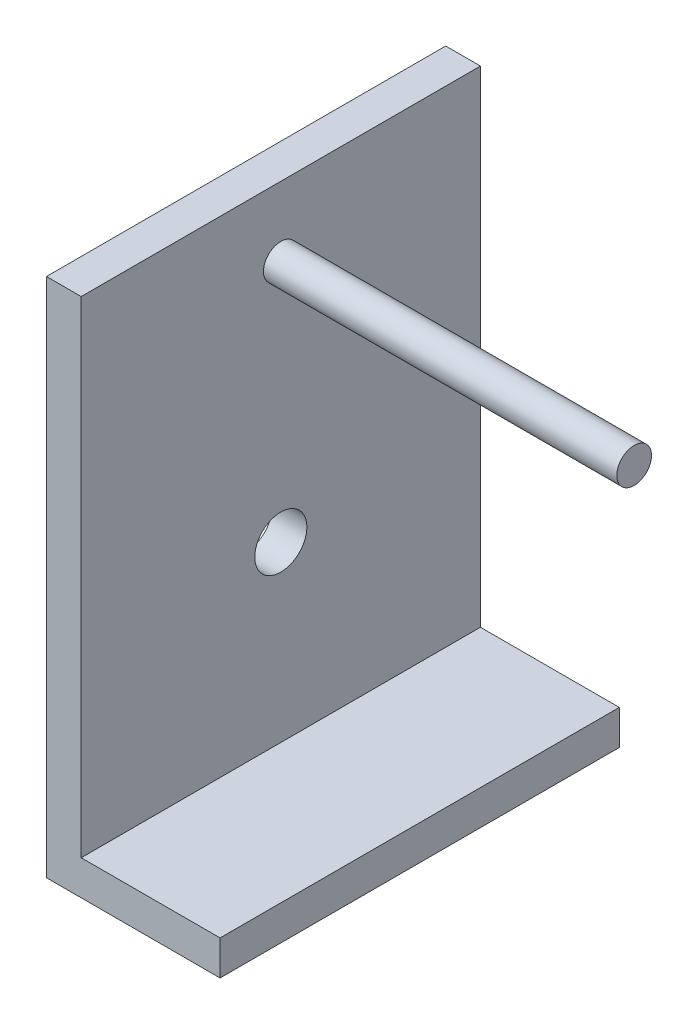
ISO-10303-21;
HEADER;
FILE_DESCRIPTION(('STEP AP214'),'2;1');
FILE_NAME('part.step','',(''),(''),'','','');
FILE_SCHEMA(('AUTOMOTIVE_DESIGN { 1 0 10303 214 1 1 1 1 }'));
ENDSEC;
DATA;
#1=APPLICATION_CONTEXT('core data for automotive mechanical design processes');
#2=APPLICATION_PROTOCOL_DEFINITION('international standard','automotive_design',2000,#1);
#3=PRODUCT_CONTEXT('',#1,'mechanical');
#4=PRODUCT('Part','Part','',(#3));
#5=PRODUCT_RELATED_PRODUCT_CATEGORY('part','',(#4));
#6=PRODUCT_DEFINITION_FORMATION('','',#4);
#7=PRODUCT_DEFINITION_CONTEXT('part definition',#1,'design');
#8=PRODUCT_DEFINITION('design','',#6,#7);
#9=PRODUCT_DEFINITION_SHAPE('','',#8);
#10=(LENGTH_UNIT() NAMED_UNIT(*) SI_UNIT(.MILLI.,.METRE.));
#11=(NAMED_UNIT(*) PLANE_ANGLE_UNIT() SI_UNIT($,.RADIAN.));
#12=(NAMED_UNIT(*) SI_UNIT($,.STERADIAN.) SOLID_ANGLE_UNIT());
#13=UNCERTAINTY_MEASURE_WITH_UNIT(LENGTH_MEASURE(1.E-05),#10,'distance_accuracy_value','');
#14=(GEOMETRIC_REPRESENTATION_CONTEXT(3) GLOBAL_UNCERTAINTY_ASSIGNED_CONTEXT((#13)) GLOBAL_UNIT_ASSIGNED_CONTEXT((#10,
#11,#12)) REPRESENTATION_CONTEXT('',''));
#15=CARTESIAN_POINT('',(0.,0.,0.));
#16=DIRECTION('',(0.,0.,1.));
#17=DIRECTION('',(1.,0.,0.));
#18=AXIS2_PLACEMENT_3D('',#15,#16,#17);
#19=CARTESIAN_POINT('',(10.,150.,57.5));
#20=DIRECTION('',(0.,-1.,0.));
#21=DIRECTION('',(0.,0.,-1.));
#22=AXIS2_PLACEMENT_3D('',#19,#20,#21);
#23=PLANE('',#22);
#24=DIRECTION('',(-1.,0.,0.));
#25=VECTOR('',#24,1.);
#26=CARTESIAN_POINT('',(10.,150.,-57.5));
#27=LINE('',#26,#25);
#28=CARTESIAN_POINT('',(10.,150.,-57.5));
#29=VERTEX_POINT('',#28);
#30=CARTESIAN_POINT('',(0.,150.,-57.5));
#31=VERTEX_POINT('',#30);
#32=EDGE_CURVE('E122',#29,#31,#27,.T.);
#33=ORIENTED_EDGE('',*,*,#32,.T.);
#34=DIRECTION('',(0.,0.,-1.));
#35=VECTOR('',#34,1.);
#36=CARTESIAN_POINT('',(0.,150.,57.5));
#37=LINE('',#36,#35);
#38=CARTESIAN_POINT('',(0.,150.,57.5));
#39=VERTEX_POINT('',#38);
#40=EDGE_CURVE('E45',#39,#31,#37,.T.);
#41=ORIENTED_EDGE('',*,*,#40,.F.);
#42=DIRECTION('',(-1.,0.,0.));
#43=VECTOR('',#42,1.);
#44=CARTESIAN_POINT('',(10.,150.,57.5));
#45=LINE('',#44,#43);
#46=CARTESIAN_POINT('',(10.,150.,57.5));
#47=VERTEX_POINT('',#46);
#48=EDGE_CURVE('E133',#47,#39,#45,.T.);
#49=ORIENTED_EDGE('',*,*,#48,.F.);
#50=DIRECTION('',(0.,0.,-1.));
#51=VECTOR('',#50,1.);
#52=CARTESIAN_POINT('',(10.,150.,57.5));
#53=LINE('',#52,#51);
#54=EDGE_CURVE('E118',#47,#29,#53,.T.);
#55=ORIENTED_EDGE('',*,*,#54,.T.);
#56=EDGE_LOOP('',(#33,#41,#49,#55));
#57=FACE_BOUND('',#56,.T.);
#58=ADVANCED_FACE('F37',(#57),#23,.F.);
#59=CARTESIAN_POINT('',(0.,150.,57.5));
#60=DIRECTION('',(1.,0.,0.));
#61=DIRECTION('',(0.,1.,0.));
#62=AXIS2_PLACEMENT_3D('',#59,#60,#61);
#63=PLANE('',#62);
#64=CARTESIAN_POINT('',(0.,60.,0.));
#65=DIRECTION('',(-1.,0.,0.));
#66=DIRECTION('',(0.,-1.,0.));
#67=AXIS2_PLACEMENT_3D('',#64,#65,#66);
#68=CIRCLE('',#67,7.49999999999999);
#69=CARTESIAN_POINT('',(0.,52.5,0.));
#70=VERTEX_POINT('',#69);
#71=EDGE_CURVE('E141',#70,#70,#68,.T.);
#72=ORIENTED_EDGE('',*,*,#71,.F.);
#73=EDGE_LOOP('',(#72));
#74=FACE_BOUND('',#73,.T.);
#75=DIRECTION('',(0.,-1.,0.));
#76=VECTOR('',#75,1.);
#77=CARTESIAN_POINT('',(0.,150.,-57.5));
#78=LINE('',#77,#76);
#79=CARTESIAN_POINT('',(0.,0.,-57.5));
#80=VERTEX_POINT('',#79);
#81=EDGE_CURVE('E125',#31,#80,#78,.T.);
#82=ORIENTED_EDGE('',*,*,#81,.T.);
#83=DIRECTION('',(0.,0.,-1.));
#84=VECTOR('',#83,1.);
#85=CARTESIAN_POINT('',(0.,0.,57.5));
#86=LINE('',#85,#84);
#87=CARTESIAN_POINT('',(0.,0.,57.5));
#88=VERTEX_POINT('',#87);
#89=EDGE_CURVE('E137',#88,#80,#86,.T.);
#90=ORIENTED_EDGE('',*,*,#89,.F.);
#91=DIRECTION('',(0.,-1.,0.));
#92=VECTOR('',#91,1.);
#93=CARTESIAN_POINT('',(0.,150.,57.5));
#94=LINE('',#93,#92);
#95=EDGE_CURVE('E91',#39,#88,#94,.T.);
#96=ORIENTED_EDGE('',*,*,#95,.F.);
#97=ORIENTED_EDGE('',*,*,#40,.T.);
#98=EDGE_LOOP('',(#82,#90,#96,#97));
#99=FACE_BOUND('',#98,.T.);
#100=ADVANCED_FACE('F155',(#74,#99),#63,.F.);
#101=CARTESIAN_POINT('',(0.,0.,57.5));
#102=DIRECTION('',(0.,1.,0.));
#103=DIRECTION('',(0.,0.,1.));
#104=AXIS2_PLACEMENT_3D('',#101,#102,#103);
#105=PLANE('',#104);
#106=DIRECTION('',(1.,0.,0.));
#107=VECTOR('',#106,1.);
#108=CARTESIAN_POINT('',(0.,0.,-57.5));
#109=LINE('',#108,#107);
#110=CARTESIAN_POINT('',(50.,0.,-57.5));
#111=VERTEX_POINT('',#110);
#112=EDGE_CURVE('E128',#80,#111,#109,.T.);
#113=ORIENTED_EDGE('',*,*,#112,.T.);
#114=DIRECTION('',(0.,0.,-1.));
#115=VECTOR('',#114,1.);
#116=CARTESIAN_POINT('',(50.,0.,57.5));
#117=LINE('',#116,#115);
#118=CARTESIAN_POINT('',(50.,0.,57.5));
#119=VERTEX_POINT('',#118);
#120=EDGE_CURVE('E113',#119,#111,#117,.T.);
#121=ORIENTED_EDGE('',*,*,#120,.F.);
#122=DIRECTION('',(1.,0.,0.));
#123=VECTOR('',#122,1.);
#124=CARTESIAN_POINT('',(0.,0.,57.5));
#125=LINE('',#124,#123);
#126=EDGE_CURVE('E104',#88,#119,#125,.T.);
#127=ORIENTED_EDGE('',*,*,#126,.F.);
#128=ORIENTED_EDGE('',*,*,#89,.T.);
#129=EDGE_LOOP('',(#113,#121,#127,#128));
#130=FACE_BOUND('',#129,.T.);
#131=ADVANCED_FACE('F158',(#130),#105,.F.);
#132=CARTESIAN_POINT('',(50.,0.,57.5));
#133=DIRECTION('',(-1.,0.,0.));
#134=DIRECTION('',(0.,0.,1.));
#135=AXIS2_PLACEMENT_3D('',#132,#133,#134);
#136=PLANE('',#135);
#137=DIRECTION('',(0.,1.,0.));
#138=VECTOR('',#137,1.);
#139=CARTESIAN_POINT('',(50.,0.,-57.5));
#140=LINE('',#139,#138);
#141=CARTESIAN_POINT('',(50.,10.,-57.5));
#142=VERTEX_POINT('',#141);
#143=EDGE_CURVE('E112',#111,#142,#140,.T.);
#144=ORIENTED_EDGE('',*,*,#143,.T.);
#145=DIRECTION('',(0.,0.,-1.));
#146=VECTOR('',#145,1.);
#147=CARTESIAN_POINT('',(50.,10.,57.5));
#148=LINE('',#147,#146);
#149=CARTESIAN_POINT('',(50.,10.,57.5));
#150=VERTEX_POINT('',#149);
#151=EDGE_CURVE('E109',#150,#142,#148,.T.);
#152=ORIENTED_EDGE('',*,*,#151,.F.);
#153=DIRECTION('',(0.,1.,0.));
#154=VECTOR('',#153,1.);
#155=CARTESIAN_POINT('',(50.,0.,57.5));
#156=LINE('',#155,#154);
#157=EDGE_CURVE('E98',#119,#150,#156,.T.);
#158=ORIENTED_EDGE('',*,*,#157,.F.);
#159=ORIENTED_EDGE('',*,*,#120,.T.);
#160=EDGE_LOOP('',(#144,#152,#158,#159));
#161=FACE_BOUND('',#160,.T.);
#162=ADVANCED_FACE('F110',(#161),#136,.F.);
#163=CARTESIAN_POINT('',(50.,10.,57.5));
#164=DIRECTION('',(0.,-1.,0.));
#165=DIRECTION('',(1.,0.,0.));
#166=AXIS2_PLACEMENT_3D('',#163,#164,#165);
#167=PLANE('',#166);
#168=DIRECTION('',(-1.,0.,0.));
#169=VECTOR('',#168,1.);
#170=CARTESIAN_POINT('',(50.,10.,-57.5));
#171=LINE('',#170,#169);
#172=CARTESIAN_POINT('',(10.,9.99999999999999,-57.5));
#173=VERTEX_POINT('',#172);
#174=EDGE_CURVE('E76',#142,#173,#171,.T.);
#175=ORIENTED_EDGE('',*,*,#174,.T.);
#176=DIRECTION('',(0.,0.,-1.));
#177=VECTOR('',#176,1.);
#178=CARTESIAN_POINT('',(10.,9.99999999999999,57.5));
#179=LINE('',#178,#177);
#180=CARTESIAN_POINT('',(10.,9.99999999999999,57.5));
#181=VERTEX_POINT('',#180);
#182=EDGE_CURVE('E114',#181,#173,#179,.T.);
#183=ORIENTED_EDGE('',*,*,#182,.F.);
#184=DIRECTION('',(-1.,0.,0.));
#185=VECTOR('',#184,1.);
#186=CARTESIAN_POINT('',(50.,10.,57.5));
#187=LINE('',#186,#185);
#188=EDGE_CURVE('E102',#150,#181,#187,.T.);
#189=ORIENTED_EDGE('',*,*,#188,.F.);
#190=ORIENTED_EDGE('',*,*,#151,.T.);
#191=EDGE_LOOP('',(#175,#183,#189,#190));
#192=FACE_BOUND('',#191,.T.);
#193=ADVANCED_FACE('F116',(#192),#167,.F.);
#194=CARTESIAN_POINT('',(10.,9.99999999999999,57.5));
#195=DIRECTION('',(-1.,0.,0.));
#196=DIRECTION('',(0.,-1.,0.));
#197=AXIS2_PLACEMENT_3D('',#194,#195,#196);
#198=PLANE('',#197);
#199=CARTESIAN_POINT('',(9.99999999999999,130.,0.));
#200=DIRECTION('',(-1.,0.,0.));
#201=DIRECTION('',(0.,-1.,0.));
#202=AXIS2_PLACEMENT_3D('',#199,#200,#201);
#203=CIRCLE('',#202,5.);
#204=CARTESIAN_POINT('',(9.99999999999999,125.,0.));
#205=VERTEX_POINT('',#204);
#206=EDGE_CURVE('E11',#205,#205,#203,.F.);
#207=ORIENTED_EDGE('',*,*,#206,.F.);
#208=EDGE_LOOP('',(#207));
#209=FACE_BOUND('',#208,.T.);
#210=CARTESIAN_POINT('',(10.,60.,0.));
#211=DIRECTION('',(-1.,0.,0.));
#212=DIRECTION('',(0.,-1.,0.));
#213=AXIS2_PLACEMENT_3D('',#210,#211,#212);
#214=CIRCLE('',#213,7.49999999999999);
#215=CARTESIAN_POINT('',(10.,52.5,0.));
#216=VERTEX_POINT('',#215);
#217=EDGE_CURVE('E126',#216,#216,#214,.T.);
#218=ORIENTED_EDGE('',*,*,#217,.T.);
#219=EDGE_LOOP('',(#218));
#220=FACE_BOUND('',#219,.T.);
#221=DIRECTION('',(0.,1.,0.));
#222=VECTOR('',#221,1.);
#223=CARTESIAN_POINT('',(10.,9.99999999999999,-57.5));
#224=LINE('',#223,#222);
#225=EDGE_CURVE('E82',#173,#29,#224,.T.);
#226=ORIENTED_EDGE('',*,*,#225,.T.);
#227=ORIENTED_EDGE('',*,*,#54,.F.);
#228=DIRECTION('',(0.,1.,0.));
#229=VECTOR('',#228,1.);
#230=CARTESIAN_POINT('',(10.,9.99999999999999,57.5));
#231=LINE('',#230,#229);
#232=EDGE_CURVE('E53',#181,#47,#231,.T.);
#233=ORIENTED_EDGE('',*,*,#232,.F.);
#234=ORIENTED_EDGE('',*,*,#182,.T.);
#235=EDGE_LOOP('',(#226,#227,#233,#234));
#236=FACE_BOUND('',#235,.T.);
#237=ADVANCED_FACE('F163',(#209,#220,#236),#198,.F.);
#238=CARTESIAN_POINT('',(0.,0.,57.5));
#239=DIRECTION('',(0.,0.,1.));
#240=DIRECTION('',(1.,0.,0.));
#241=AXIS2_PLACEMENT_3D('',#238,#239,#240);
#242=PLANE('',#241);
#243=ORIENTED_EDGE('',*,*,#48,.T.);
#244=ORIENTED_EDGE('',*,*,#95,.T.);
#245=ORIENTED_EDGE('',*,*,#126,.T.);
#246=ORIENTED_EDGE('',*,*,#157,.T.);
#247=ORIENTED_EDGE('',*,*,#188,.T.);
#248=ORIENTED_EDGE('',*,*,#232,.T.);
#249=EDGE_LOOP('',(#243,#244,#245,#246,#247,#248));
#250=FACE_BOUND('',#249,.T.);
#251=ADVANCED_FACE('F100',(#250),#242,.T.);
#252=CARTESIAN_POINT('',(0.,0.,-57.5));
#253=DIRECTION('',(0.,0.,1.));
#254=DIRECTION('',(1.,0.,0.));
#255=AXIS2_PLACEMENT_3D('',#252,#253,#254);
#256=PLANE('',#255);
#257=ORIENTED_EDGE('',*,*,#32,.F.);
#258=ORIENTED_EDGE('',*,*,#225,.F.);
#259=ORIENTED_EDGE('',*,*,#174,.F.);
#260=ORIENTED_EDGE('',*,*,#143,.F.);
#261=ORIENTED_EDGE('',*,*,#112,.F.);
#262=ORIENTED_EDGE('',*,*,#81,.F.);
#263=EDGE_LOOP('',(#257,#258,#259,#260,#261,#262));
#264=FACE_BOUND('',#263,.T.);
#265=ADVANCED_FACE('F161',(#264),#256,.F.);
#266=CARTESIAN_POINT('',(50.,60.,0.));
#267=DIRECTION('',(-1.,0.,0.));
#268=DIRECTION('',(0.,-1.,0.));
#269=AXIS2_PLACEMENT_3D('',#266,#267,#268);
#270=CYLINDRICAL_SURFACE('',#269,7.49999999999999);
#271=ORIENTED_EDGE('',*,*,#71,.T.);
#272=EDGE_LOOP('',(#271));
#273=FACE_BOUND('',#272,.T.);
#274=ORIENTED_EDGE('',*,*,#217,.F.);
#275=EDGE_LOOP('',(#274));
#276=FACE_BOUND('',#275,.T.);
#277=ADVANCED_FACE('F209',(#273,#276),#270,.F.);
#278=CARTESIAN_POINT('',(111.780663763355,130.,0.));
#279=DIRECTION('',(-1.,0.,0.));
#280=DIRECTION('',(0.,-1.,0.));
#281=AXIS2_PLACEMENT_3D('',#278,#279,#280);
#282=CYLINDRICAL_SURFACE('',#281,5.);
#283=CARTESIAN_POINT('',(111.780663763355,130.,0.));
#284=DIRECTION('',(1.,0.,0.));
#285=DIRECTION('',(0.,1.,0.));
#286=AXIS2_PLACEMENT_3D('',#283,#284,#285);
#287=CIRCLE('',#286,5.);
#288=CARTESIAN_POINT('',(111.780663763355,135.,0.));
#289=VERTEX_POINT('',#288);
#290=EDGE_CURVE('E145',#289,#289,#287,.T.);
#291=ORIENTED_EDGE('',*,*,#290,.F.);
#292=EDGE_LOOP('',(#291));
#293=FACE_BOUND('',#292,.T.);
#294=ORIENTED_EDGE('',*,*,#206,.T.);
#295=EDGE_LOOP('',(#294));
#296=FACE_BOUND('',#295,.T.);
#297=ADVANCED_FACE('F223',(#293,#296),#282,.T.);
#298=CARTESIAN_POINT('',(111.780663763355,130.,0.));
#299=DIRECTION('',(1.,0.,0.));
#300=DIRECTION('',(0.,1.,0.));
#301=AXIS2_PLACEMENT_3D('',#298,#299,#300);
#302=PLANE('',#301);
#303=ORIENTED_EDGE('',*,*,#290,.T.);
#304=EDGE_LOOP('',(#303));
#305=FACE_BOUND('',#304,.T.);
#306=ADVANCED_FACE('F236',(#305),#302,.T.);
#307=CLOSED_SHELL('',(#58,#100,#131,#162,#193,#237,#251,#265,#277,#297,#306));
#308=MANIFOLD_SOLID_BREP('B2',#307);
#309=ADVANCED_BREP_SHAPE_REPRESENTATION('',(#18,#308),#14);
#310=SHAPE_DEFINITION_REPRESENTATION(#9,#309);
ENDSEC;
END-ISO-10303-21;
